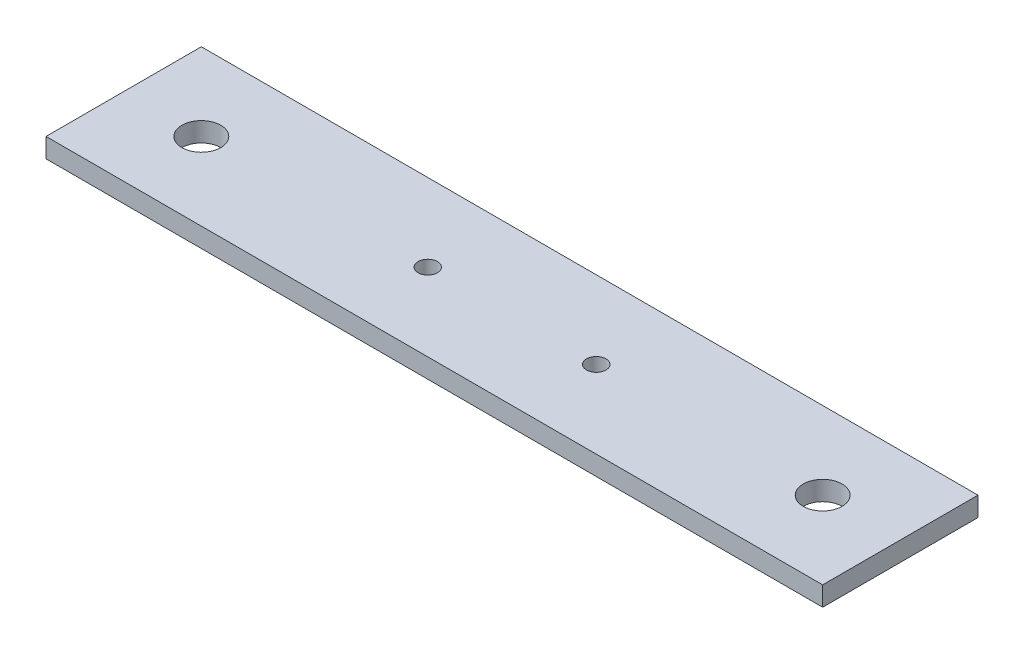
ISO-10303-21;
HEADER;
FILE_DESCRIPTION(('STEP AP214'),'2;1');
FILE_NAME('part.step','',(''),(''),'','','');
FILE_SCHEMA(('AUTOMOTIVE_DESIGN { 1 0 10303 214 1 1 1 1 }'));
ENDSEC;
DATA;
#1=APPLICATION_CONTEXT('core data for automotive mechanical design processes');
#2=APPLICATION_PROTOCOL_DEFINITION('international standard','automotive_design',2000,#1);
#3=PRODUCT_CONTEXT('',#1,'mechanical');
#4=PRODUCT('Part','Part','',(#3));
#5=PRODUCT_RELATED_PRODUCT_CATEGORY('part','',(#4));
#6=PRODUCT_DEFINITION_FORMATION('','',#4);
#7=PRODUCT_DEFINITION_CONTEXT('part definition',#1,'design');
#8=PRODUCT_DEFINITION('design','',#6,#7);
#9=PRODUCT_DEFINITION_SHAPE('','',#8);
#10=(LENGTH_UNIT() NAMED_UNIT(*) SI_UNIT(.MILLI.,.METRE.));
#11=(NAMED_UNIT(*) PLANE_ANGLE_UNIT() SI_UNIT($,.RADIAN.));
#12=(NAMED_UNIT(*) SI_UNIT($,.STERADIAN.) SOLID_ANGLE_UNIT());
#13=UNCERTAINTY_MEASURE_WITH_UNIT(LENGTH_MEASURE(1.E-05),#10,'distance_accuracy_value','');
#14=(GEOMETRIC_REPRESENTATION_CONTEXT(3) GLOBAL_UNCERTAINTY_ASSIGNED_CONTEXT((#13)) GLOBAL_UNIT_ASSIGNED_CONTEXT((#10,
#11,#12)) REPRESENTATION_CONTEXT('',''));
#15=CARTESIAN_POINT('',(0.,0.,0.));
#16=DIRECTION('',(0.,0.,1.));
#17=DIRECTION('',(1.,0.,0.));
#18=AXIS2_PLACEMENT_3D('',#15,#16,#17);
#19=CARTESIAN_POINT('',(0.,3.175,0.));
#20=DIRECTION('',(0.,1.,0.));
#21=DIRECTION('',(0.,0.,1.));
#22=AXIS2_PLACEMENT_3D('',#19,#20,#21);
#23=PLANE('',#22);
#24=CARTESIAN_POINT('',(-13.774801,3.175,0.));
#25=DIRECTION('',(0.,1.,0.));
#26=DIRECTION('',(0.,0.,1.));
#27=AXIS2_PLACEMENT_3D('',#24,#25,#26);
#28=CIRCLE('',#27,1.5875);
#29=CARTESIAN_POINT('',(-13.774801,3.175,1.5875));
#30=VERTEX_POINT('',#29);
#31=EDGE_CURVE('E120',#30,#30,#28,.T.);
#32=ORIENTED_EDGE('',*,*,#31,.F.);
#33=EDGE_LOOP('',(#32));
#34=FACE_BOUND('',#33,.T.);
#35=CARTESIAN_POINT('',(-50.8,3.175,0.));
#36=DIRECTION('',(0.,1.,0.));
#37=DIRECTION('',(0.,0.,1.));
#38=AXIS2_PLACEMENT_3D('',#35,#36,#37);
#39=CIRCLE('',#38,3.175);
#40=CARTESIAN_POINT('',(-50.8,3.175,3.175));
#41=VERTEX_POINT('',#40);
#42=EDGE_CURVE('E99',#41,#41,#39,.T.);
#43=ORIENTED_EDGE('',*,*,#42,.F.);
#44=EDGE_LOOP('',(#43));
#45=FACE_BOUND('',#44,.T.);
#46=DIRECTION('',(0.,0.,1.));
#47=VECTOR('',#46,1.);
#48=CARTESIAN_POINT('',(-63.5,3.175,12.7));
#49=LINE('',#48,#47);
#50=CARTESIAN_POINT('',(-63.5,3.175,-12.7));
#51=VERTEX_POINT('',#50);
#52=CARTESIAN_POINT('',(-63.5,3.175,12.7));
#53=VERTEX_POINT('',#52);
#54=EDGE_CURVE('E84',#51,#53,#49,.T.);
#55=ORIENTED_EDGE('',*,*,#54,.T.);
#56=DIRECTION('',(1.,0.,0.));
#57=VECTOR('',#56,1.);
#58=CARTESIAN_POINT('',(63.5,3.175,12.7));
#59=LINE('',#58,#57);
#60=CARTESIAN_POINT('',(63.5,3.175,12.7));
#61=VERTEX_POINT('',#60);
#62=EDGE_CURVE('E79',#53,#61,#59,.T.);
#63=ORIENTED_EDGE('',*,*,#62,.T.);
#64=DIRECTION('',(0.,0.,-1.));
#65=VECTOR('',#64,1.);
#66=CARTESIAN_POINT('',(63.5,3.175,12.7));
#67=LINE('',#66,#65);
#68=CARTESIAN_POINT('',(63.5,3.175,-12.7));
#69=VERTEX_POINT('',#68);
#70=EDGE_CURVE('E82',#61,#69,#67,.T.);
#71=ORIENTED_EDGE('',*,*,#70,.T.);
#72=DIRECTION('',(-1.,0.,0.));
#73=VECTOR('',#72,1.);
#74=CARTESIAN_POINT('',(63.5,3.175,-12.7));
#75=LINE('',#74,#73);
#76=EDGE_CURVE('E49',#69,#51,#75,.T.);
#77=ORIENTED_EDGE('',*,*,#76,.T.);
#78=EDGE_LOOP('',(#55,#63,#71,#77));
#79=FACE_BOUND('',#78,.T.);
#80=CARTESIAN_POINT('',(50.8,3.175,0.));
#81=DIRECTION('',(0.,1.,0.));
#82=DIRECTION('',(0.,0.,1.));
#83=AXIS2_PLACEMENT_3D('',#80,#81,#82);
#84=CIRCLE('',#83,3.175);
#85=CARTESIAN_POINT('',(50.8,3.175,3.17499999999998));
#86=VERTEX_POINT('',#85);
#87=EDGE_CURVE('E114',#86,#86,#84,.T.);
#88=ORIENTED_EDGE('',*,*,#87,.F.);
#89=EDGE_LOOP('',(#88));
#90=FACE_BOUND('',#89,.T.);
#91=CARTESIAN_POINT('',(13.774801,3.175,0.));
#92=DIRECTION('',(0.,1.,0.));
#93=DIRECTION('',(0.,0.,1.));
#94=AXIS2_PLACEMENT_3D('',#91,#92,#93);
#95=CIRCLE('',#94,1.5875);
#96=CARTESIAN_POINT('',(13.774801,3.175,1.5875));
#97=VERTEX_POINT('',#96);
#98=EDGE_CURVE('E126',#97,#97,#95,.T.);
#99=ORIENTED_EDGE('',*,*,#98,.F.);
#100=EDGE_LOOP('',(#99));
#101=FACE_BOUND('',#100,.T.);
#102=ADVANCED_FACE('F32',(#34,#45,#79,#90,#101),#23,.T.);
#103=CARTESIAN_POINT('',(0.,0.,0.));
#104=DIRECTION('',(0.,1.,0.));
#105=DIRECTION('',(0.,0.,1.));
#106=AXIS2_PLACEMENT_3D('',#103,#104,#105);
#107=PLANE('',#106);
#108=DIRECTION('',(0.,0.,1.));
#109=VECTOR('',#108,1.);
#110=CARTESIAN_POINT('',(-63.5,0.,12.7));
#111=LINE('',#110,#109);
#112=CARTESIAN_POINT('',(-63.5,0.,-12.7));
#113=VERTEX_POINT('',#112);
#114=CARTESIAN_POINT('',(-63.5,0.,12.7));
#115=VERTEX_POINT('',#114);
#116=EDGE_CURVE('E96',#113,#115,#111,.T.);
#117=ORIENTED_EDGE('',*,*,#116,.F.);
#118=DIRECTION('',(-1.,0.,0.));
#119=VECTOR('',#118,1.);
#120=CARTESIAN_POINT('',(63.5,0.,-12.7));
#121=LINE('',#120,#119);
#122=CARTESIAN_POINT('',(63.5,0.,-12.7));
#123=VERTEX_POINT('',#122);
#124=EDGE_CURVE('E72',#123,#113,#121,.T.);
#125=ORIENTED_EDGE('',*,*,#124,.F.);
#126=DIRECTION('',(0.,0.,-1.));
#127=VECTOR('',#126,1.);
#128=CARTESIAN_POINT('',(63.5,0.,12.7));
#129=LINE('',#128,#127);
#130=CARTESIAN_POINT('',(63.5,0.,12.7));
#131=VERTEX_POINT('',#130);
#132=EDGE_CURVE('E66',#131,#123,#129,.T.);
#133=ORIENTED_EDGE('',*,*,#132,.F.);
#134=DIRECTION('',(1.,0.,0.));
#135=VECTOR('',#134,1.);
#136=CARTESIAN_POINT('',(63.5,0.,12.7));
#137=LINE('',#136,#135);
#138=EDGE_CURVE('E88',#115,#131,#137,.T.);
#139=ORIENTED_EDGE('',*,*,#138,.F.);
#140=EDGE_LOOP('',(#117,#125,#133,#139));
#141=FACE_BOUND('',#140,.T.);
#142=CARTESIAN_POINT('',(-50.8,0.,0.));
#143=DIRECTION('',(0.,1.,0.));
#144=DIRECTION('',(0.,0.,1.));
#145=AXIS2_PLACEMENT_3D('',#142,#143,#144);
#146=CIRCLE('',#145,3.175);
#147=CARTESIAN_POINT('',(-50.8,0.,3.175));
#148=VERTEX_POINT('',#147);
#149=EDGE_CURVE('E111',#148,#148,#146,.T.);
#150=ORIENTED_EDGE('',*,*,#149,.T.);
#151=EDGE_LOOP('',(#150));
#152=FACE_BOUND('',#151,.T.);
#153=CARTESIAN_POINT('',(50.8,0.,0.));
#154=DIRECTION('',(0.,1.,0.));
#155=DIRECTION('',(0.,0.,1.));
#156=AXIS2_PLACEMENT_3D('',#153,#154,#155);
#157=CIRCLE('',#156,3.175);
#158=CARTESIAN_POINT('',(50.8,0.,3.17499999999998));
#159=VERTEX_POINT('',#158);
#160=EDGE_CURVE('E117',#159,#159,#157,.T.);
#161=ORIENTED_EDGE('',*,*,#160,.T.);
#162=EDGE_LOOP('',(#161));
#163=FACE_BOUND('',#162,.T.);
#164=CARTESIAN_POINT('',(-13.774801,0.,0.));
#165=DIRECTION('',(0.,1.,0.));
#166=DIRECTION('',(0.,0.,1.));
#167=AXIS2_PLACEMENT_3D('',#164,#165,#166);
#168=CIRCLE('',#167,1.5875);
#169=CARTESIAN_POINT('',(-13.774801,0.,1.5875));
#170=VERTEX_POINT('',#169);
#171=EDGE_CURVE('E123',#170,#170,#168,.T.);
#172=ORIENTED_EDGE('',*,*,#171,.T.);
#173=EDGE_LOOP('',(#172));
#174=FACE_BOUND('',#173,.T.);
#175=CARTESIAN_POINT('',(13.774801,0.,0.));
#176=DIRECTION('',(0.,1.,0.));
#177=DIRECTION('',(0.,0.,1.));
#178=AXIS2_PLACEMENT_3D('',#175,#176,#177);
#179=CIRCLE('',#178,1.5875);
#180=CARTESIAN_POINT('',(13.774801,0.,1.5875));
#181=VERTEX_POINT('',#180);
#182=EDGE_CURVE('E129',#181,#181,#179,.T.);
#183=ORIENTED_EDGE('',*,*,#182,.T.);
#184=EDGE_LOOP('',(#183));
#185=FACE_BOUND('',#184,.T.);
#186=ADVANCED_FACE('F107',(#141,#152,#163,#174,#185),#107,.F.);
#187=CARTESIAN_POINT('',(-63.5,3.175,12.7));
#188=DIRECTION('',(1.,0.,0.));
#189=DIRECTION('',(0.,0.,-1.));
#190=AXIS2_PLACEMENT_3D('',#187,#188,#189);
#191=PLANE('',#190);
#192=ORIENTED_EDGE('',*,*,#116,.T.);
#193=DIRECTION('',(0.,-1.,0.));
#194=VECTOR('',#193,1.);
#195=CARTESIAN_POINT('',(-63.5,3.175,12.7));
#196=LINE('',#195,#194);
#197=EDGE_CURVE('E11',#53,#115,#196,.T.);
#198=ORIENTED_EDGE('',*,*,#197,.F.);
#199=ORIENTED_EDGE('',*,*,#54,.F.);
#200=DIRECTION('',(0.,-1.,0.));
#201=VECTOR('',#200,1.);
#202=CARTESIAN_POINT('',(-63.5,3.175,-12.7));
#203=LINE('',#202,#201);
#204=EDGE_CURVE('E92',#51,#113,#203,.T.);
#205=ORIENTED_EDGE('',*,*,#204,.T.);
#206=EDGE_LOOP('',(#192,#198,#199,#205));
#207=FACE_BOUND('',#206,.T.);
#208=ADVANCED_FACE('F34',(#207),#191,.F.);
#209=CARTESIAN_POINT('',(63.5,3.175,12.7));
#210=DIRECTION('',(0.,0.,-1.));
#211=DIRECTION('',(-1.,0.,0.));
#212=AXIS2_PLACEMENT_3D('',#209,#210,#211);
#213=PLANE('',#212);
#214=ORIENTED_EDGE('',*,*,#138,.T.);
#215=DIRECTION('',(0.,-1.,0.));
#216=VECTOR('',#215,1.);
#217=CARTESIAN_POINT('',(63.5,3.175,12.7));
#218=LINE('',#217,#216);
#219=EDGE_CURVE('E41',#61,#131,#218,.T.);
#220=ORIENTED_EDGE('',*,*,#219,.F.);
#221=ORIENTED_EDGE('',*,*,#62,.F.);
#222=ORIENTED_EDGE('',*,*,#197,.T.);
#223=EDGE_LOOP('',(#214,#220,#221,#222));
#224=FACE_BOUND('',#223,.T.);
#225=ADVANCED_FACE('F87',(#224),#213,.F.);
#226=CARTESIAN_POINT('',(63.5,3.175,12.7));
#227=DIRECTION('',(-1.,0.,0.));
#228=DIRECTION('',(0.,0.,1.));
#229=AXIS2_PLACEMENT_3D('',#226,#227,#228);
#230=PLANE('',#229);
#231=ORIENTED_EDGE('',*,*,#132,.T.);
#232=DIRECTION('',(0.,-1.,0.));
#233=VECTOR('',#232,1.);
#234=CARTESIAN_POINT('',(63.5,3.175,-12.7));
#235=LINE('',#234,#233);
#236=EDGE_CURVE('E89',#69,#123,#235,.T.);
#237=ORIENTED_EDGE('',*,*,#236,.F.);
#238=ORIENTED_EDGE('',*,*,#70,.F.);
#239=ORIENTED_EDGE('',*,*,#219,.T.);
#240=EDGE_LOOP('',(#231,#237,#238,#239));
#241=FACE_BOUND('',#240,.T.);
#242=ADVANCED_FACE('F90',(#241),#230,.F.);
#243=CARTESIAN_POINT('',(63.5,3.175,-12.7));
#244=DIRECTION('',(0.,0.,1.));
#245=DIRECTION('',(1.,0.,0.));
#246=AXIS2_PLACEMENT_3D('',#243,#244,#245);
#247=PLANE('',#246);
#248=ORIENTED_EDGE('',*,*,#124,.T.);
#249=ORIENTED_EDGE('',*,*,#204,.F.);
#250=ORIENTED_EDGE('',*,*,#76,.F.);
#251=ORIENTED_EDGE('',*,*,#236,.T.);
#252=EDGE_LOOP('',(#248,#249,#250,#251));
#253=FACE_BOUND('',#252,.T.);
#254=ADVANCED_FACE('F104',(#253),#247,.F.);
#255=CARTESIAN_POINT('',(-50.8,3.175,0.));
#256=DIRECTION('',(0.,-1.,0.));
#257=DIRECTION('',(0.,0.,-1.));
#258=AXIS2_PLACEMENT_3D('',#255,#256,#257);
#259=CYLINDRICAL_SURFACE('',#258,3.175);
#260=ORIENTED_EDGE('',*,*,#42,.T.);
#261=EDGE_LOOP('',(#260));
#262=FACE_BOUND('',#261,.T.);
#263=ORIENTED_EDGE('',*,*,#149,.F.);
#264=EDGE_LOOP('',(#263));
#265=FACE_BOUND('',#264,.T.);
#266=ADVANCED_FACE('F148',(#262,#265),#259,.F.);
#267=CARTESIAN_POINT('',(50.8,3.175,0.));
#268=DIRECTION('',(0.,-1.,0.));
#269=DIRECTION('',(0.,0.,-1.));
#270=AXIS2_PLACEMENT_3D('',#267,#268,#269);
#271=CYLINDRICAL_SURFACE('',#270,3.175);
#272=ORIENTED_EDGE('',*,*,#87,.T.);
#273=EDGE_LOOP('',(#272));
#274=FACE_BOUND('',#273,.T.);
#275=ORIENTED_EDGE('',*,*,#160,.F.);
#276=EDGE_LOOP('',(#275));
#277=FACE_BOUND('',#276,.T.);
#278=ADVANCED_FACE('F194',(#274,#277),#271,.F.);
#279=CARTESIAN_POINT('',(-13.774801,3.175,0.));
#280=DIRECTION('',(0.,-1.,0.));
#281=DIRECTION('',(0.,0.,-1.));
#282=AXIS2_PLACEMENT_3D('',#279,#280,#281);
#283=CYLINDRICAL_SURFACE('',#282,1.5875);
#284=ORIENTED_EDGE('',*,*,#31,.T.);
#285=EDGE_LOOP('',(#284));
#286=FACE_BOUND('',#285,.T.);
#287=ORIENTED_EDGE('',*,*,#171,.F.);
#288=EDGE_LOOP('',(#287));
#289=FACE_BOUND('',#288,.T.);
#290=ADVANCED_FACE('F202',(#286,#289),#283,.F.);
#291=CARTESIAN_POINT('',(13.774801,3.175,0.));
#292=DIRECTION('',(0.,-1.,0.));
#293=DIRECTION('',(0.,0.,-1.));
#294=AXIS2_PLACEMENT_3D('',#291,#292,#293);
#295=CYLINDRICAL_SURFACE('',#294,1.5875);
#296=ORIENTED_EDGE('',*,*,#98,.T.);
#297=EDGE_LOOP('',(#296));
#298=FACE_BOUND('',#297,.T.);
#299=ORIENTED_EDGE('',*,*,#182,.F.);
#300=EDGE_LOOP('',(#299));
#301=FACE_BOUND('',#300,.T.);
#302=ADVANCED_FACE('F135',(#298,#301),#295,.F.);
#303=CLOSED_SHELL('',(#102,#186,#208,#225,#242,#254,#266,#278,#290,#302));
#304=MANIFOLD_SOLID_BREP('B2',#303);
#305=ADVANCED_BREP_SHAPE_REPRESENTATION('',(#18,#304),#14);
#306=SHAPE_DEFINITION_REPRESENTATION(#9,#305);
ENDSEC;
END-ISO-10303-21;
